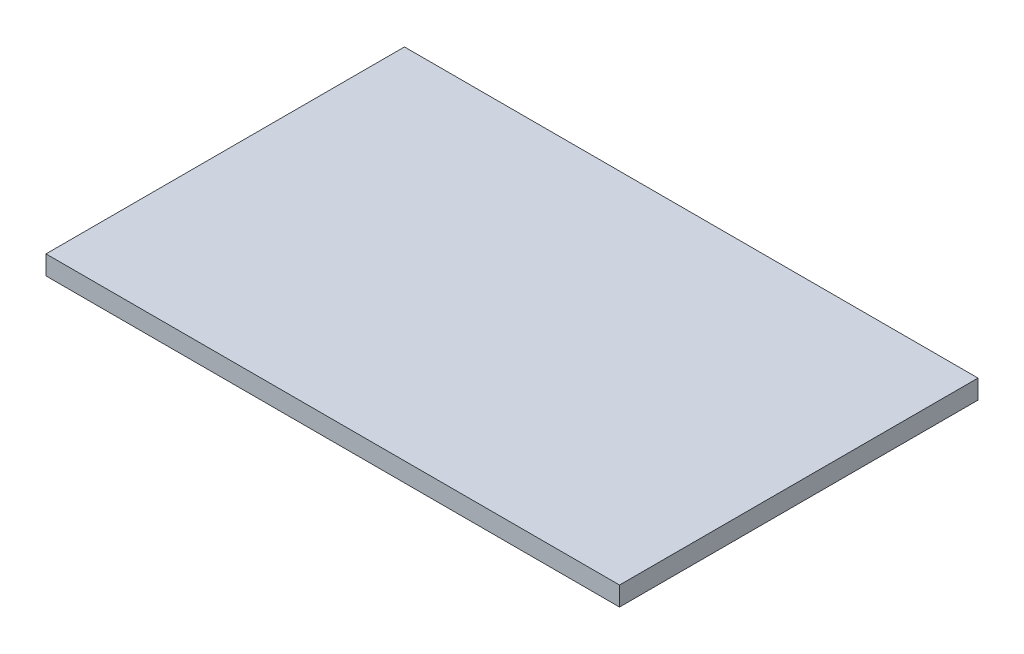
ISO-10303-21;
HEADER;
FILE_DESCRIPTION(('STEP AP214'),'2;1');
FILE_NAME('part.step','',(''),(''),'','','');
FILE_SCHEMA(('AUTOMOTIVE_DESIGN { 1 0 10303 214 1 1 1 1 }'));
ENDSEC;
DATA;
#1=APPLICATION_CONTEXT('core data for automotive mechanical design processes');
#2=APPLICATION_PROTOCOL_DEFINITION('international standard','automotive_design',2000,#1);
#3=PRODUCT_CONTEXT('',#1,'mechanical');
#4=PRODUCT('Part','Part','',(#3));
#5=PRODUCT_RELATED_PRODUCT_CATEGORY('part','',(#4));
#6=PRODUCT_DEFINITION_FORMATION('','',#4);
#7=PRODUCT_DEFINITION_CONTEXT('part definition',#1,'design');
#8=PRODUCT_DEFINITION('design','',#6,#7);
#9=PRODUCT_DEFINITION_SHAPE('','',#8);
#10=(LENGTH_UNIT() NAMED_UNIT(*) SI_UNIT(.MILLI.,.METRE.));
#11=(NAMED_UNIT(*) PLANE_ANGLE_UNIT() SI_UNIT($,.RADIAN.));
#12=(NAMED_UNIT(*) SI_UNIT($,.STERADIAN.) SOLID_ANGLE_UNIT());
#13=UNCERTAINTY_MEASURE_WITH_UNIT(LENGTH_MEASURE(1.E-05),#10,'distance_accuracy_value','');
#14=(GEOMETRIC_REPRESENTATION_CONTEXT(3) GLOBAL_UNCERTAINTY_ASSIGNED_CONTEXT((#13)) GLOBAL_UNIT_ASSIGNED_CONTEXT((#10,
#11,#12)) REPRESENTATION_CONTEXT('',''));
#15=CARTESIAN_POINT('',(0.,0.,0.));
#16=DIRECTION('',(0.,0.,1.));
#17=DIRECTION('',(1.,0.,0.));
#18=AXIS2_PLACEMENT_3D('',#15,#16,#17);
#19=CARTESIAN_POINT('',(0.,1.6,0.));
#20=DIRECTION('',(1.,0.,0.));
#21=DIRECTION('',(0.,0.,-1.));
#22=AXIS2_PLACEMENT_3D('',#19,#20,#21);
#23=PLANE('',#22);
#24=DIRECTION('',(0.,0.,1.));
#25=VECTOR('',#24,1.);
#26=CARTESIAN_POINT('',(0.,0.,0.));
#27=LINE('',#26,#25);
#28=CARTESIAN_POINT('',(0.,0.,-30.));
#29=VERTEX_POINT('',#28);
#30=CARTESIAN_POINT('',(0.,0.,0.));
#31=VERTEX_POINT('',#30);
#32=EDGE_CURVE('E96',#29,#31,#27,.T.);
#33=ORIENTED_EDGE('',*,*,#32,.T.);
#34=DIRECTION('',(0.,-1.,0.));
#35=VECTOR('',#34,1.);
#36=CARTESIAN_POINT('',(0.,1.6,0.));
#37=LINE('',#36,#35);
#38=CARTESIAN_POINT('',(0.,1.6,0.));
#39=VERTEX_POINT('',#38);
#40=EDGE_CURVE('E11',#39,#31,#37,.T.);
#41=ORIENTED_EDGE('',*,*,#40,.F.);
#42=DIRECTION('',(0.,0.,1.));
#43=VECTOR('',#42,1.);
#44=CARTESIAN_POINT('',(0.,1.6,0.));
#45=LINE('',#44,#43);
#46=CARTESIAN_POINT('',(0.,1.6,-30.));
#47=VERTEX_POINT('',#46);
#48=EDGE_CURVE('E84',#47,#39,#45,.T.);
#49=ORIENTED_EDGE('',*,*,#48,.F.);
#50=DIRECTION('',(0.,-1.,0.));
#51=VECTOR('',#50,1.);
#52=CARTESIAN_POINT('',(0.,1.6,-30.));
#53=LINE('',#52,#51);
#54=EDGE_CURVE('E92',#47,#29,#53,.T.);
#55=ORIENTED_EDGE('',*,*,#54,.T.);
#56=EDGE_LOOP('',(#33,#41,#49,#55));
#57=FACE_BOUND('',#56,.T.);
#58=ADVANCED_FACE('F33',(#57),#23,.F.);
#59=CARTESIAN_POINT('',(0.,1.6,0.));
#60=DIRECTION('',(0.,0.,-1.));
#61=DIRECTION('',(-1.,0.,0.));
#62=AXIS2_PLACEMENT_3D('',#59,#60,#61);
#63=PLANE('',#62);
#64=DIRECTION('',(1.,0.,0.));
#65=VECTOR('',#64,1.);
#66=CARTESIAN_POINT('',(0.,0.,0.));
#67=LINE('',#66,#65);
#68=CARTESIAN_POINT('',(48.,0.,0.));
#69=VERTEX_POINT('',#68);
#70=EDGE_CURVE('E88',#31,#69,#67,.T.);
#71=ORIENTED_EDGE('',*,*,#70,.T.);
#72=DIRECTION('',(0.,-1.,0.));
#73=VECTOR('',#72,1.);
#74=CARTESIAN_POINT('',(48.,1.6,0.));
#75=LINE('',#74,#73);
#76=CARTESIAN_POINT('',(48.,1.6,0.));
#77=VERTEX_POINT('',#76);
#78=EDGE_CURVE('E41',#77,#69,#75,.T.);
#79=ORIENTED_EDGE('',*,*,#78,.F.);
#80=DIRECTION('',(1.,0.,0.));
#81=VECTOR('',#80,1.);
#82=CARTESIAN_POINT('',(0.,1.6,0.));
#83=LINE('',#82,#81);
#84=EDGE_CURVE('E79',#39,#77,#83,.T.);
#85=ORIENTED_EDGE('',*,*,#84,.F.);
#86=ORIENTED_EDGE('',*,*,#40,.T.);
#87=EDGE_LOOP('',(#71,#79,#85,#86));
#88=FACE_BOUND('',#87,.T.);
#89=ADVANCED_FACE('F87',(#88),#63,.F.);
#90=CARTESIAN_POINT('',(48.,1.6,0.));
#91=DIRECTION('',(-1.,0.,0.));
#92=DIRECTION('',(0.,0.,1.));
#93=AXIS2_PLACEMENT_3D('',#90,#91,#92);
#94=PLANE('',#93);
#95=DIRECTION('',(0.,0.,-1.));
#96=VECTOR('',#95,1.);
#97=CARTESIAN_POINT('',(48.,0.,0.));
#98=LINE('',#97,#96);
#99=CARTESIAN_POINT('',(48.,0.,-30.));
#100=VERTEX_POINT('',#99);
#101=EDGE_CURVE('E66',#69,#100,#98,.T.);
#102=ORIENTED_EDGE('',*,*,#101,.T.);
#103=DIRECTION('',(0.,-1.,0.));
#104=VECTOR('',#103,1.);
#105=CARTESIAN_POINT('',(48.,1.6,-30.));
#106=LINE('',#105,#104);
#107=CARTESIAN_POINT('',(48.,1.6,-30.));
#108=VERTEX_POINT('',#107);
#109=EDGE_CURVE('E89',#108,#100,#106,.T.);
#110=ORIENTED_EDGE('',*,*,#109,.F.);
#111=DIRECTION('',(0.,0.,-1.));
#112=VECTOR('',#111,1.);
#113=CARTESIAN_POINT('',(48.,1.6,0.));
#114=LINE('',#113,#112);
#115=EDGE_CURVE('E82',#77,#108,#114,.T.);
#116=ORIENTED_EDGE('',*,*,#115,.F.);
#117=ORIENTED_EDGE('',*,*,#78,.T.);
#118=EDGE_LOOP('',(#102,#110,#116,#117));
#119=FACE_BOUND('',#118,.T.);
#120=ADVANCED_FACE('F90',(#119),#94,.F.);
#121=CARTESIAN_POINT('',(0.,1.6,-30.));
#122=DIRECTION('',(0.,0.,1.));
#123=DIRECTION('',(1.,0.,0.));
#124=AXIS2_PLACEMENT_3D('',#121,#122,#123);
#125=PLANE('',#124);
#126=DIRECTION('',(-1.,0.,0.));
#127=VECTOR('',#126,1.);
#128=CARTESIAN_POINT('',(0.,0.,-30.));
#129=LINE('',#128,#127);
#130=EDGE_CURVE('E72',#100,#29,#129,.T.);
#131=ORIENTED_EDGE('',*,*,#130,.T.);
#132=ORIENTED_EDGE('',*,*,#54,.F.);
#133=DIRECTION('',(-1.,0.,0.));
#134=VECTOR('',#133,1.);
#135=CARTESIAN_POINT('',(0.,1.6,-30.));
#136=LINE('',#135,#134);
#137=EDGE_CURVE('E49',#108,#47,#136,.T.);
#138=ORIENTED_EDGE('',*,*,#137,.F.);
#139=ORIENTED_EDGE('',*,*,#109,.T.);
#140=EDGE_LOOP('',(#131,#132,#138,#139));
#141=FACE_BOUND('',#140,.T.);
#142=ADVANCED_FACE('F103',(#141),#125,.F.);
#143=CARTESIAN_POINT('',(0.,1.6,0.));
#144=DIRECTION('',(0.,-1.,0.));
#145=DIRECTION('',(0.,0.,-1.));
#146=AXIS2_PLACEMENT_3D('',#143,#144,#145);
#147=PLANE('',#146);
#148=ORIENTED_EDGE('',*,*,#48,.T.);
#149=ORIENTED_EDGE('',*,*,#84,.T.);
#150=ORIENTED_EDGE('',*,*,#115,.T.);
#151=ORIENTED_EDGE('',*,*,#137,.T.);
#152=EDGE_LOOP('',(#148,#149,#150,#151));
#153=FACE_BOUND('',#152,.T.);
#154=ADVANCED_FACE('F80',(#153),#147,.F.);
#155=CARTESIAN_POINT('',(0.,0.,0.));
#156=DIRECTION('',(0.,-1.,0.));
#157=DIRECTION('',(0.,0.,-1.));
#158=AXIS2_PLACEMENT_3D('',#155,#156,#157);
#159=PLANE('',#158);
#160=ORIENTED_EDGE('',*,*,#32,.F.);
#161=ORIENTED_EDGE('',*,*,#130,.F.);
#162=ORIENTED_EDGE('',*,*,#101,.F.);
#163=ORIENTED_EDGE('',*,*,#70,.F.);
#164=EDGE_LOOP('',(#160,#161,#162,#163));
#165=FACE_BOUND('',#164,.T.);
#166=ADVANCED_FACE('F106',(#165),#159,.T.);
#167=CLOSED_SHELL('',(#58,#89,#120,#142,#154,#166));
#168=MANIFOLD_SOLID_BREP('B2',#167);
#169=ADVANCED_BREP_SHAPE_REPRESENTATION('',(#18,#168),#14);
#170=SHAPE_DEFINITION_REPRESENTATION(#9,#169);
ENDSEC;
END-ISO-10303-21;
